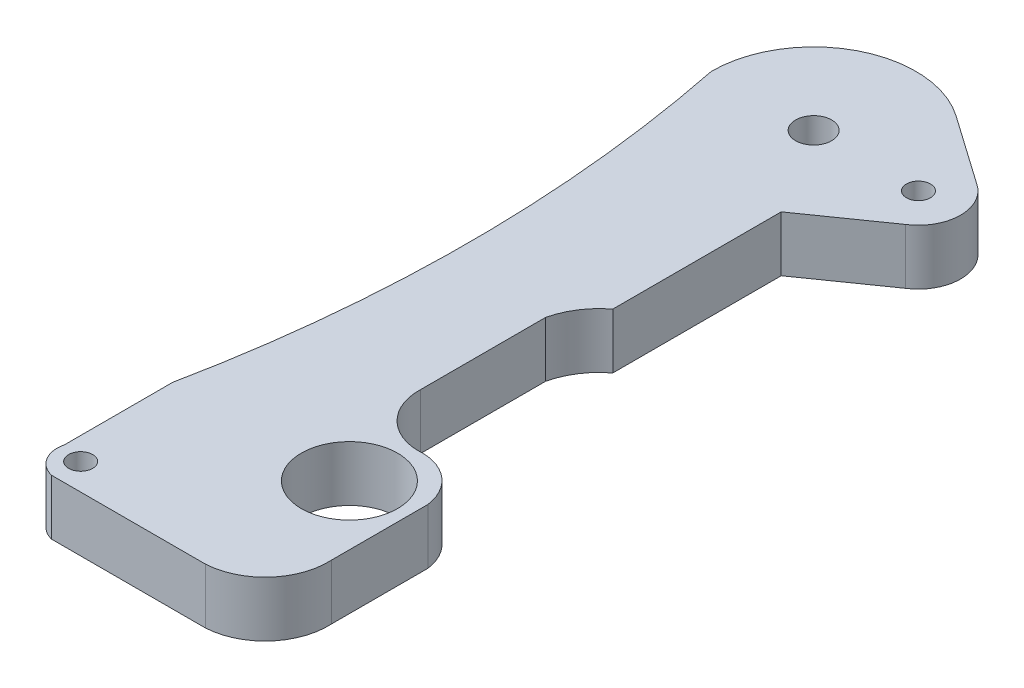
ISO-10303-21;
HEADER;
FILE_DESCRIPTION(('STEP AP214'),'2;1');
FILE_NAME('part.step','',(''),(''),'','','');
FILE_SCHEMA(('AUTOMOTIVE_DESIGN { 1 0 10303 214 1 1 1 1 }'));
ENDSEC;
DATA;
#1=APPLICATION_CONTEXT('core data for automotive mechanical design processes');
#2=APPLICATION_PROTOCOL_DEFINITION('international standard','automotive_design',2000,#1);
#3=PRODUCT_CONTEXT('',#1,'mechanical');
#4=PRODUCT('Part','Part','',(#3));
#5=PRODUCT_RELATED_PRODUCT_CATEGORY('part','',(#4));
#6=PRODUCT_DEFINITION_FORMATION('','',#4);
#7=PRODUCT_DEFINITION_CONTEXT('part definition',#1,'design');
#8=PRODUCT_DEFINITION('design','',#6,#7);
#9=PRODUCT_DEFINITION_SHAPE('','',#8);
#10=(LENGTH_UNIT() NAMED_UNIT(*) SI_UNIT(.MILLI.,.METRE.));
#11=(NAMED_UNIT(*) PLANE_ANGLE_UNIT() SI_UNIT($,.RADIAN.));
#12=(NAMED_UNIT(*) SI_UNIT($,.STERADIAN.) SOLID_ANGLE_UNIT());
#13=UNCERTAINTY_MEASURE_WITH_UNIT(LENGTH_MEASURE(1.E-05),#10,'distance_accuracy_value','');
#14=(GEOMETRIC_REPRESENTATION_CONTEXT(3) GLOBAL_UNCERTAINTY_ASSIGNED_CONTEXT((#13)) GLOBAL_UNIT_ASSIGNED_CONTEXT((#10,
#11,#12)) REPRESENTATION_CONTEXT('',''));
#15=CARTESIAN_POINT('',(0.,0.,0.));
#16=DIRECTION('',(0.,0.,1.));
#17=DIRECTION('',(1.,0.,0.));
#18=AXIS2_PLACEMENT_3D('',#15,#16,#17);
#19=CARTESIAN_POINT('',(0.,4.6,-14.739469580212));
#20=DIRECTION('',(0.,0.,-1.));
#21=DIRECTION('',(-1.,0.,0.));
#22=AXIS2_PLACEMENT_3D('',#19,#20,#21);
#23=PLANE('',#22);
#24=DIRECTION('',(1.,0.,0.));
#25=VECTOR('',#24,1.);
#26=CARTESIAN_POINT('',(0.,0.,-14.739469580212));
#27=LINE('',#26,#25);
#28=CARTESIAN_POINT('',(23.3424677458322,0.,-14.739469580212));
#29=VERTEX_POINT('',#28);
#30=CARTESIAN_POINT('',(36.1321842689916,0.,-14.739469580212));
#31=VERTEX_POINT('',#30);
#32=EDGE_CURVE('E207',#29,#31,#27,.T.);
#33=ORIENTED_EDGE('',*,*,#32,.T.);
#34=DIRECTION('',(0.,-1.,0.));
#35=VECTOR('',#34,1.);
#36=CARTESIAN_POINT('',(36.1321842689916,4.6,-14.739469580212));
#37=LINE('',#36,#35);
#38=CARTESIAN_POINT('',(36.1321842689916,4.6,-14.739469580212));
#39=VERTEX_POINT('',#38);
#40=EDGE_CURVE('E11',#39,#31,#37,.T.);
#41=ORIENTED_EDGE('',*,*,#40,.F.);
#42=DIRECTION('',(1.,0.,0.));
#43=VECTOR('',#42,1.);
#44=CARTESIAN_POINT('',(0.,4.6,-14.739469580212));
#45=LINE('',#44,#43);
#46=CARTESIAN_POINT('',(23.3424677458322,4.6,-14.739469580212));
#47=VERTEX_POINT('',#46);
#48=EDGE_CURVE('E640',#47,#39,#45,.T.);
#49=ORIENTED_EDGE('',*,*,#48,.F.);
#50=DIRECTION('',(0.,-1.,0.));
#51=VECTOR('',#50,1.);
#52=CARTESIAN_POINT('',(23.3424677458322,4.6,-14.739469580212));
#53=LINE('',#52,#51);
#54=EDGE_CURVE('E187',#47,#29,#53,.T.);
#55=ORIENTED_EDGE('',*,*,#54,.T.);
#56=EDGE_LOOP('',(#33,#41,#49,#55));
#57=FACE_BOUND('',#56,.T.);
#58=ADVANCED_FACE('F47',(#57),#23,.F.);
#59=CARTESIAN_POINT('',(35.8456908181647,4.6,-19.9845961419274));
#60=DIRECTION('',(0.,-1.,0.));
#61=DIRECTION('',(0.,0.,-1.));
#62=AXIS2_PLACEMENT_3D('',#59,#60,#61);
#63=CYLINDRICAL_SURFACE('',#62,5.2529449974066);
#64=CARTESIAN_POINT('',(35.8456908181647,0.,-19.9845961419274));
#65=DIRECTION('',(0.,1.,0.));
#66=DIRECTION('',(0.,0.,1.));
#67=AXIS2_PLACEMENT_3D('',#64,#65,#66);
#68=CIRCLE('',#67,5.2529449974066);
#69=CARTESIAN_POINT('',(41.09081737988,0.,-20.2710895927543));
#70=VERTEX_POINT('',#69);
#71=EDGE_CURVE('E211',#31,#70,#68,.T.);
#72=ORIENTED_EDGE('',*,*,#71,.T.);
#73=DIRECTION('',(0.,-1.,0.));
#74=VECTOR('',#73,1.);
#75=CARTESIAN_POINT('',(41.09081737988,4.6,-20.2710895927543));
#76=LINE('',#75,#74);
#77=CARTESIAN_POINT('',(41.09081737988,4.6,-20.2710895927543));
#78=VERTEX_POINT('',#77);
#79=EDGE_CURVE('E57',#78,#70,#76,.T.);
#80=ORIENTED_EDGE('',*,*,#79,.F.);
#81=CARTESIAN_POINT('',(35.8456908181647,4.6,-19.9845961419274));
#82=DIRECTION('',(0.,1.,0.));
#83=DIRECTION('',(0.,0.,1.));
#84=AXIS2_PLACEMENT_3D('',#81,#82,#83);
#85=CIRCLE('',#84,5.2529449974066);
#86=EDGE_CURVE('E125',#39,#78,#85,.T.);
#87=ORIENTED_EDGE('',*,*,#86,.F.);
#88=ORIENTED_EDGE('',*,*,#40,.T.);
#89=EDGE_LOOP('',(#72,#80,#87,#88));
#90=FACE_BOUND('',#89,.T.);
#91=ADVANCED_FACE('F368',(#90),#63,.T.);
#92=CARTESIAN_POINT('',(41.09081737988,4.6,0.));
#93=DIRECTION('',(-1.,0.,0.));
#94=DIRECTION('',(0.,0.,1.));
#95=AXIS2_PLACEMENT_3D('',#92,#93,#94);
#96=PLANE('',#95);
#97=DIRECTION('',(0.,0.,-1.));
#98=VECTOR('',#97,1.);
#99=CARTESIAN_POINT('',(41.09081737988,0.,0.));
#100=LINE('',#99,#98);
#101=CARTESIAN_POINT('',(41.09081737988,0.,-28.2862941007237));
#102=VERTEX_POINT('',#101);
#103=EDGE_CURVE('E214',#70,#102,#100,.T.);
#104=ORIENTED_EDGE('',*,*,#103,.T.);
#105=DIRECTION('',(0.,-1.,0.));
#106=VECTOR('',#105,1.);
#107=CARTESIAN_POINT('',(41.09081737988,4.6,-28.2862941007237));
#108=LINE('',#107,#106);
#109=CARTESIAN_POINT('',(41.09081737988,4.6,-28.2862941007237));
#110=VERTEX_POINT('',#109);
#111=EDGE_CURVE('E290',#110,#102,#108,.T.);
#112=ORIENTED_EDGE('',*,*,#111,.F.);
#113=DIRECTION('',(0.,0.,-1.));
#114=VECTOR('',#113,1.);
#115=CARTESIAN_POINT('',(41.09081737988,4.6,0.));
#116=LINE('',#115,#114);
#117=EDGE_CURVE('E300',#78,#110,#116,.T.);
#118=ORIENTED_EDGE('',*,*,#117,.F.);
#119=ORIENTED_EDGE('',*,*,#79,.T.);
#120=EDGE_LOOP('',(#104,#112,#118,#119));
#121=FACE_BOUND('',#120,.T.);
#122=ADVANCED_FACE('F298',(#121),#96,.F.);
#123=CARTESIAN_POINT('',(37.1255272206283,4.6,-27.7604861957421));
#124=DIRECTION('',(0.,-1.,0.));
#125=DIRECTION('',(0.,0.,-1.));
#126=AXIS2_PLACEMENT_3D('',#123,#124,#125);
#127=CYLINDRICAL_SURFACE('',#126,4.);
#128=CARTESIAN_POINT('',(37.1255272206283,0.,-27.7604861957421));
#129=DIRECTION('',(0.,1.,0.));
#130=DIRECTION('',(0.,0.,1.));
#131=AXIS2_PLACEMENT_3D('',#128,#129,#130);
#132=CIRCLE('',#131,4.);
#133=CARTESIAN_POINT('',(36.7123387364667,0.,-31.7390883719538));
#134=VERTEX_POINT('',#133);
#135=EDGE_CURVE('E217',#102,#134,#132,.T.);
#136=ORIENTED_EDGE('',*,*,#135,.T.);
#137=DIRECTION('',(0.,-1.,0.));
#138=VECTOR('',#137,1.);
#139=CARTESIAN_POINT('',(36.7123387364667,4.6,-31.7390883719538));
#140=LINE('',#139,#138);
#141=CARTESIAN_POINT('',(36.7123387364667,4.6,-31.7390883719538));
#142=VERTEX_POINT('',#141);
#143=EDGE_CURVE('E286',#142,#134,#140,.T.);
#144=ORIENTED_EDGE('',*,*,#143,.F.);
#145=CARTESIAN_POINT('',(37.1255272206283,4.6,-27.7604861957421));
#146=DIRECTION('',(0.,1.,0.));
#147=DIRECTION('',(0.,0.,1.));
#148=AXIS2_PLACEMENT_3D('',#145,#146,#147);
#149=CIRCLE('',#148,4.);
#150=EDGE_CURVE('E319',#110,#142,#149,.T.);
#151=ORIENTED_EDGE('',*,*,#150,.F.);
#152=ORIENTED_EDGE('',*,*,#111,.T.);
#153=EDGE_LOOP('',(#136,#144,#151,#152));
#154=FACE_BOUND('',#153,.T.);
#155=ADVANCED_FACE('F309',(#154),#127,.T.);
#156=CARTESIAN_POINT('',(36.8735410270205,4.6,-36.092931668784));
#157=DIRECTION('',(0.,-1.,0.));
#158=DIRECTION('',(0.,0.,-1.));
#159=AXIS2_PLACEMENT_3D('',#156,#157,#158);
#160=CYLINDRICAL_SURFACE('',#159,4.35682655516985);
#161=CARTESIAN_POINT('',(36.8735410270205,0.,-36.092931668784));
#162=DIRECTION('',(0.,1.,0.));
#163=DIRECTION('',(0.,0.,1.));
#164=AXIS2_PLACEMENT_3D('',#161,#162,#163);
#165=CIRCLE('',#164,4.35682655516985);
#166=CARTESIAN_POINT('',(32.5196977301903,0.,-36.2541339593378));
#167=VERTEX_POINT('',#166);
#168=EDGE_CURVE('E220',#134,#167,#165,.F.);
#169=ORIENTED_EDGE('',*,*,#168,.T.);
#170=DIRECTION('',(0.,-1.,0.));
#171=VECTOR('',#170,1.);
#172=CARTESIAN_POINT('',(32.5196977301903,4.6,-36.2541339593378));
#173=LINE('',#172,#171);
#174=CARTESIAN_POINT('',(32.5196977301903,4.6,-36.2541339593378));
#175=VERTEX_POINT('',#174);
#176=EDGE_CURVE('E282',#175,#167,#173,.T.);
#177=ORIENTED_EDGE('',*,*,#176,.F.);
#178=CARTESIAN_POINT('',(36.8735410270205,4.6,-36.092931668784));
#179=DIRECTION('',(0.,1.,0.));
#180=DIRECTION('',(0.,0.,1.));
#181=AXIS2_PLACEMENT_3D('',#178,#179,#180);
#182=CIRCLE('',#181,4.35682655516985);
#183=EDGE_CURVE('E315',#142,#175,#182,.F.);
#184=ORIENTED_EDGE('',*,*,#183,.F.);
#185=ORIENTED_EDGE('',*,*,#143,.T.);
#186=EDGE_LOOP('',(#169,#177,#184,#185));
#187=FACE_BOUND('',#186,.T.);
#188=ADVANCED_FACE('F313',(#187),#160,.F.);
#189=CARTESIAN_POINT('',(32.5196977301903,4.6,0.));
#190=DIRECTION('',(-1.,0.,0.));
#191=DIRECTION('',(0.,0.,1.));
#192=AXIS2_PLACEMENT_3D('',#189,#190,#191);
#193=PLANE('',#192);
#194=DIRECTION('',(0.,0.,-1.));
#195=VECTOR('',#194,1.);
#196=CARTESIAN_POINT('',(32.5196977301903,0.,0.));
#197=LINE('',#196,#195);
#198=CARTESIAN_POINT('',(32.5196977301903,0.,-46.6400327583967));
#199=VERTEX_POINT('',#198);
#200=EDGE_CURVE('E223',#167,#199,#197,.T.);
#201=ORIENTED_EDGE('',*,*,#200,.T.);
#202=DIRECTION('',(0.,-1.,0.));
#203=VECTOR('',#202,1.);
#204=CARTESIAN_POINT('',(32.5196977301903,4.6,-46.6400327583967));
#205=LINE('',#204,#203);
#206=CARTESIAN_POINT('',(32.5196977301903,4.6,-46.6400327583967));
#207=VERTEX_POINT('',#206);
#208=EDGE_CURVE('E278',#207,#199,#205,.T.);
#209=ORIENTED_EDGE('',*,*,#208,.F.);
#210=DIRECTION('',(0.,0.,-1.));
#211=VECTOR('',#210,1.);
#212=CARTESIAN_POINT('',(32.5196977301903,4.6,0.));
#213=LINE('',#212,#211);
#214=EDGE_CURVE('E318',#175,#207,#213,.T.);
#215=ORIENTED_EDGE('',*,*,#214,.F.);
#216=ORIENTED_EDGE('',*,*,#176,.T.);
#217=EDGE_LOOP('',(#201,#209,#215,#216));
#218=FACE_BOUND('',#217,.T.);
#219=ADVANCED_FACE('F547',(#218),#193,.F.);
#220=CARTESIAN_POINT('',(38.3164986371318,4.6,-45.2892608143263));
#221=DIRECTION('',(0.,-1.,0.));
#222=DIRECTION('',(0.,0.,-1.));
#223=AXIS2_PLACEMENT_3D('',#220,#221,#222);
#224=CYLINDRICAL_SURFACE('',#223,5.95209925989195);
#225=CARTESIAN_POINT('',(38.3164986371318,0.,-45.2892608143263));
#226=DIRECTION('',(0.,1.,0.));
#227=DIRECTION('',(0.,0.,1.));
#228=AXIS2_PLACEMENT_3D('',#225,#226,#227);
#229=CIRCLE('',#228,5.95209925989195);
#230=CARTESIAN_POINT('',(34.7131963883495,0.,-50.0267388885264));
#231=VERTEX_POINT('',#230);
#232=EDGE_CURVE('E226',#199,#231,#229,.F.);
#233=ORIENTED_EDGE('',*,*,#232,.T.);
#234=DIRECTION('',(0.,-1.,0.));
#235=VECTOR('',#234,1.);
#236=CARTESIAN_POINT('',(34.7131963883495,4.6,-50.0267388885264));
#237=LINE('',#236,#235);
#238=CARTESIAN_POINT('',(34.7131963883495,4.6,-50.0267388885264));
#239=VERTEX_POINT('',#238);
#240=EDGE_CURVE('E275',#239,#231,#237,.T.);
#241=ORIENTED_EDGE('',*,*,#240,.F.);
#242=CARTESIAN_POINT('',(38.3164986371318,4.6,-45.2892608143263));
#243=DIRECTION('',(0.,1.,0.));
#244=DIRECTION('',(0.,0.,1.));
#245=AXIS2_PLACEMENT_3D('',#242,#243,#244);
#246=CIRCLE('',#245,5.95209925989195);
#247=EDGE_CURVE('E323',#207,#239,#246,.F.);
#248=ORIENTED_EDGE('',*,*,#247,.F.);
#249=ORIENTED_EDGE('',*,*,#208,.T.);
#250=EDGE_LOOP('',(#233,#241,#248,#249));
#251=FACE_BOUND('',#250,.T.);
#252=ADVANCED_FACE('F537',(#251),#224,.F.);
#253=CARTESIAN_POINT('',(34.7131963883496,4.6,0.));
#254=DIRECTION('',(1.,0.,0.));
#255=DIRECTION('',(0.,0.,-1.));
#256=AXIS2_PLACEMENT_3D('',#253,#254,#255);
#257=PLANE('',#256);
#258=DIRECTION('',(0.,0.,1.));
#259=VECTOR('',#258,1.);
#260=CARTESIAN_POINT('',(34.7131963883496,0.,0.));
#261=LINE('',#260,#259);
#262=CARTESIAN_POINT('',(34.7131963883495,0.,-64.0267388885264));
#263=VERTEX_POINT('',#262);
#264=EDGE_CURVE('E230',#263,#231,#261,.T.);
#265=ORIENTED_EDGE('',*,*,#264,.F.);
#266=DIRECTION('',(0.,-1.,0.));
#267=VECTOR('',#266,1.);
#268=CARTESIAN_POINT('',(34.7131963883495,4.6,-64.0267388885264));
#269=LINE('',#268,#267);
#270=CARTESIAN_POINT('',(34.7131963883495,4.6,-64.0267388885264));
#271=VERTEX_POINT('',#270);
#272=EDGE_CURVE('E272',#271,#263,#269,.T.);
#273=ORIENTED_EDGE('',*,*,#272,.F.);
#274=DIRECTION('',(0.,0.,1.));
#275=VECTOR('',#274,1.);
#276=CARTESIAN_POINT('',(34.7131963883496,4.6,0.));
#277=LINE('',#276,#275);
#278=EDGE_CURVE('E330',#271,#239,#277,.T.);
#279=ORIENTED_EDGE('',*,*,#278,.T.);
#280=ORIENTED_EDGE('',*,*,#240,.T.);
#281=EDGE_LOOP('',(#265,#273,#279,#280));
#282=FACE_BOUND('',#281,.T.);
#283=ADVANCED_FACE('F527',(#282),#257,.T.);
#284=CARTESIAN_POINT('',(-18.6535235605097,4.6,-26.5931798477903));
#285=DIRECTION('',(0.574253354174526,0.,0.81867764426501));
#286=DIRECTION('',(0.81867764426501,0.,-0.574253354174526));
#287=AXIS2_PLACEMENT_3D('',#284,#285,#286);
#288=PLANE('',#287);
#289=DIRECTION('',(-0.81867764426501,0.,0.574253354174526));
#290=VECTOR('',#289,1.);
#291=CARTESIAN_POINT('',(-18.6535235605097,0.,-26.5931798477903));
#292=LINE('',#291,#290);
#293=CARTESIAN_POINT('',(40.7852701998782,0.,-68.2859351393243));
#294=VERTEX_POINT('',#293);
#295=EDGE_CURVE('E234',#294,#263,#292,.T.);
#296=ORIENTED_EDGE('',*,*,#295,.F.);
#297=DIRECTION('',(0.,-1.,0.));
#298=VECTOR('',#297,1.);
#299=CARTESIAN_POINT('',(40.7852701998782,4.6,-68.2859351393243));
#300=LINE('',#299,#298);
#301=CARTESIAN_POINT('',(40.7852701998782,4.6,-68.2859351393243));
#302=VERTEX_POINT('',#301);
#303=EDGE_CURVE('E269',#302,#294,#300,.T.);
#304=ORIENTED_EDGE('',*,*,#303,.F.);
#305=DIRECTION('',(-0.81867764426501,0.,0.574253354174526));
#306=VECTOR('',#305,1.);
#307=CARTESIAN_POINT('',(-18.6535235605097,4.6,-26.5931798477903));
#308=LINE('',#307,#306);
#309=EDGE_CURVE('E334',#302,#271,#308,.T.);
#310=ORIENTED_EDGE('',*,*,#309,.T.);
#311=ORIENTED_EDGE('',*,*,#272,.T.);
#312=EDGE_LOOP('',(#296,#304,#310,#311));
#313=FACE_BOUND('',#312,.T.);
#314=ADVANCED_FACE('F518',(#313),#288,.T.);
#315=CARTESIAN_POINT('',(38.907336679625,4.6,-71.239469580212));
#316=DIRECTION('',(0.,-1.,0.));
#317=DIRECTION('',(0.,0.,-1.));
#318=AXIS2_PLACEMENT_3D('',#315,#316,#317);
#319=CYLINDRICAL_SURFACE('',#318,3.5);
#320=CARTESIAN_POINT('',(38.907336679625,0.,-71.239469580212));
#321=DIRECTION('',(0.,1.,0.));
#322=DIRECTION('',(0.,0.,1.));
#323=AXIS2_PLACEMENT_3D('',#320,#321,#322);
#324=CIRCLE('',#323,3.5);
#325=CARTESIAN_POINT('',(40.7852701998782,0.,-74.1930040210996));
#326=VERTEX_POINT('',#325);
#327=EDGE_CURVE('E238',#294,#326,#324,.T.);
#328=ORIENTED_EDGE('',*,*,#327,.T.);
#329=DIRECTION('',(0.,-1.,0.));
#330=VECTOR('',#329,1.);
#331=CARTESIAN_POINT('',(40.7852701998782,4.6,-74.1930040210996));
#332=LINE('',#331,#330);
#333=CARTESIAN_POINT('',(40.7852701998782,4.6,-74.1930040210996));
#334=VERTEX_POINT('',#333);
#335=EDGE_CURVE('E266',#334,#326,#332,.T.);
#336=ORIENTED_EDGE('',*,*,#335,.F.);
#337=CARTESIAN_POINT('',(38.907336679625,4.6,-71.239469580212));
#338=DIRECTION('',(0.,1.,0.));
#339=DIRECTION('',(0.,0.,1.));
#340=AXIS2_PLACEMENT_3D('',#337,#338,#339);
#341=CIRCLE('',#340,3.5);
#342=EDGE_CURVE('E338',#302,#334,#341,.T.);
#343=ORIENTED_EDGE('',*,*,#342,.F.);
#344=ORIENTED_EDGE('',*,*,#303,.T.);
#345=EDGE_LOOP('',(#328,#336,#343,#344));
#346=FACE_BOUND('',#345,.T.);
#347=ADVANCED_FACE('F353',(#346),#319,.T.);
#348=CARTESIAN_POINT('',(48.3298697480119,4.6,-68.9009191244746));
#349=DIRECTION('',(0.574253354174525,0.,-0.818677644265011));
#350=DIRECTION('',(-0.818677644265011,0.,-0.574253354174525));
#351=AXIS2_PLACEMENT_3D('',#348,#349,#350);
#352=PLANE('',#351);
#353=DIRECTION('',(0.818677644265011,0.,0.574253354174525));
#354=VECTOR('',#353,1.);
#355=CARTESIAN_POINT('',(48.3298697480119,0.,-68.9009191244746));
#356=LINE('',#355,#354);
#357=CARTESIAN_POINT('',(35.0752667977107,0.,-78.1982295564646));
#358=VERTEX_POINT('',#357);
#359=EDGE_CURVE('E242',#358,#326,#356,.T.);
#360=ORIENTED_EDGE('',*,*,#359,.F.);
#361=DIRECTION('',(0.,-1.,0.));
#362=VECTOR('',#361,1.);
#363=CARTESIAN_POINT('',(35.0752667977107,4.6,-78.1982295564646));
#364=LINE('',#363,#362);
#365=CARTESIAN_POINT('',(35.0752667977107,4.6,-78.1982295564646));
#366=VERTEX_POINT('',#365);
#367=EDGE_CURVE('E263',#366,#358,#364,.T.);
#368=ORIENTED_EDGE('',*,*,#367,.F.);
#369=DIRECTION('',(0.818677644265011,0.,0.574253354174525));
#370=VECTOR('',#369,1.);
#371=CARTESIAN_POINT('',(48.3298697480119,4.6,-68.9009191244746));
#372=LINE('',#371,#370);
#373=EDGE_CURVE('E341',#366,#334,#372,.T.);
#374=ORIENTED_EDGE('',*,*,#373,.T.);
#375=ORIENTED_EDGE('',*,*,#335,.T.);
#376=EDGE_LOOP('',(#360,#368,#374,#375));
#377=FACE_BOUND('',#376,.T.);
#378=ADVANCED_FACE('F347',(#377),#352,.T.);
#379=CARTESIAN_POINT('',(30.1941132872272,4.6,-71.239469580212));
#380=DIRECTION('',(0.,-1.,0.));
#381=DIRECTION('',(0.,0.,-1.));
#382=AXIS2_PLACEMENT_3D('',#379,#380,#381);
#383=CYLINDRICAL_SURFACE('',#382,8.5);
#384=CARTESIAN_POINT('',(30.1941132872272,0.,-71.239469580212));
#385=DIRECTION('',(0.,1.,0.));
#386=DIRECTION('',(0.,0.,1.));
#387=AXIS2_PLACEMENT_3D('',#384,#385,#386);
#388=CIRCLE('',#387,8.5);
#389=CARTESIAN_POINT('',(21.6941132872272,0.,-71.239469580212));
#390=VERTEX_POINT('',#389);
#391=EDGE_CURVE('E246',#358,#390,#388,.T.);
#392=ORIENTED_EDGE('',*,*,#391,.T.);
#393=DIRECTION('',(0.,-1.,0.));
#394=VECTOR('',#393,1.);
#395=CARTESIAN_POINT('',(21.6941132872272,4.6,-71.239469580212));
#396=LINE('',#395,#394);
#397=CARTESIAN_POINT('',(21.6941132872272,4.6,-71.239469580212));
#398=VERTEX_POINT('',#397);
#399=EDGE_CURVE('E181',#398,#390,#396,.T.);
#400=ORIENTED_EDGE('',*,*,#399,.F.);
#401=CARTESIAN_POINT('',(30.1941132872272,4.6,-71.239469580212));
#402=DIRECTION('',(0.,1.,0.));
#403=DIRECTION('',(0.,0.,1.));
#404=AXIS2_PLACEMENT_3D('',#401,#402,#403);
#405=CIRCLE('',#404,8.5);
#406=EDGE_CURVE('E166',#366,#398,#405,.T.);
#407=ORIENTED_EDGE('',*,*,#406,.F.);
#408=ORIENTED_EDGE('',*,*,#367,.T.);
#409=EDGE_LOOP('',(#392,#400,#407,#408));
#410=FACE_BOUND('',#409,.T.);
#411=ADVANCED_FACE('F358',(#410),#383,.T.);
#412=CARTESIAN_POINT('',(-88.6741516737802,4.6,-48.8513825944135));
#413=DIRECTION('',(0.,-1.,0.));
#414=DIRECTION('',(0.,0.,-1.));
#415=AXIS2_PLACEMENT_3D('',#412,#413,#414);
#416=CYLINDRICAL_SURFACE('',#415,112.616075004356);
#417=CARTESIAN_POINT('',(-88.6741516737802,0.,-48.8513825944135));
#418=DIRECTION('',(0.,1.,0.));
#419=DIRECTION('',(0.,0.,1.));
#420=AXIS2_PLACEMENT_3D('',#417,#418,#419);
#421=CIRCLE('',#420,112.616075004356);
#422=CARTESIAN_POINT('',(21.6941132872273,0.,-26.4632956086153));
#423=VERTEX_POINT('',#422);
#424=EDGE_CURVE('E176',#390,#423,#421,.F.);
#425=ORIENTED_EDGE('',*,*,#424,.T.);
#426=DIRECTION('',(0.,-1.,0.));
#427=VECTOR('',#426,1.);
#428=CARTESIAN_POINT('',(21.6941132872273,4.6,-26.4632956086153));
#429=LINE('',#428,#427);
#430=CARTESIAN_POINT('',(21.6941132872273,4.6,-26.4632956086153));
#431=VERTEX_POINT('',#430);
#432=EDGE_CURVE('E173',#431,#423,#429,.T.);
#433=ORIENTED_EDGE('',*,*,#432,.F.);
#434=CARTESIAN_POINT('',(-88.6741516737802,4.6,-48.8513825944135));
#435=DIRECTION('',(0.,1.,0.));
#436=DIRECTION('',(0.,0.,1.));
#437=AXIS2_PLACEMENT_3D('',#434,#435,#436);
#438=CIRCLE('',#437,112.616075004356);
#439=EDGE_CURVE('E159',#398,#431,#438,.F.);
#440=ORIENTED_EDGE('',*,*,#439,.F.);
#441=ORIENTED_EDGE('',*,*,#399,.T.);
#442=EDGE_LOOP('',(#425,#433,#440,#441));
#443=FACE_BOUND('',#442,.T.);
#444=ADVANCED_FACE('F174',(#443),#416,.F.);
#445=CARTESIAN_POINT('',(21.6941132872271,4.6,1.33807244835034E-13));
#446=DIRECTION('',(-1.,0.,0.));
#447=DIRECTION('',(0.,0.,1.));
#448=AXIS2_PLACEMENT_3D('',#445,#446,#447);
#449=PLANE('',#448);
#450=DIRECTION('',(0.,0.,-1.));
#451=VECTOR('',#450,1.);
#452=CARTESIAN_POINT('',(21.6941132872271,0.,1.33807244835034E-13));
#453=LINE('',#452,#451);
#454=CARTESIAN_POINT('',(21.6941132872272,0.,-17.4632956086153));
#455=VERTEX_POINT('',#454);
#456=EDGE_CURVE('E251',#455,#423,#453,.T.);
#457=ORIENTED_EDGE('',*,*,#456,.F.);
#458=DIRECTION('',(0.,-1.,0.));
#459=VECTOR('',#458,1.);
#460=CARTESIAN_POINT('',(21.6941132872272,4.6,-17.4632956086153));
#461=LINE('',#460,#459);
#462=CARTESIAN_POINT('',(21.6941132872272,4.6,-17.4632956086153));
#463=VERTEX_POINT('',#462);
#464=EDGE_CURVE('E114',#463,#455,#461,.T.);
#465=ORIENTED_EDGE('',*,*,#464,.F.);
#466=DIRECTION('',(0.,0.,-1.));
#467=VECTOR('',#466,1.);
#468=CARTESIAN_POINT('',(21.6941132872271,4.6,1.33807244835034E-13));
#469=LINE('',#468,#467);
#470=EDGE_CURVE('E163',#463,#431,#469,.T.);
#471=ORIENTED_EDGE('',*,*,#470,.T.);
#472=ORIENTED_EDGE('',*,*,#432,.T.);
#473=EDGE_LOOP('',(#457,#465,#471,#472));
#474=FACE_BOUND('',#473,.T.);
#475=ADVANCED_FACE('F183',(#474),#449,.T.);
#476=CARTESIAN_POINT('',(36.1321842689916,4.6,-26.71617415409));
#477=DIRECTION('',(0.,-1.,0.));
#478=DIRECTION('',(0.,0.,-1.));
#479=AXIS2_PLACEMENT_3D('',#476,#477,#478);
#480=CYLINDRICAL_SURFACE('',#479,4.00000000000001);
#481=CARTESIAN_POINT('',(36.1321842689916,4.6,-26.71617415409));
#482=DIRECTION('',(0.,1.,0.));
#483=DIRECTION('',(0.,0.,1.));
#484=AXIS2_PLACEMENT_3D('',#481,#482,#483);
#485=CIRCLE('',#484,4.00000000000001);
#486=CARTESIAN_POINT('',(36.1321842689916,4.6,-22.71617415409));
#487=VERTEX_POINT('',#486);
#488=EDGE_CURVE('E638',#487,#487,#485,.T.);
#489=ORIENTED_EDGE('',*,*,#488,.T.);
#490=EDGE_LOOP('',(#489));
#491=FACE_BOUND('',#490,.T.);
#492=CARTESIAN_POINT('',(36.1321842689916,0.,-26.71617415409));
#493=DIRECTION('',(0.,1.,0.));
#494=DIRECTION('',(0.,0.,1.));
#495=AXIS2_PLACEMENT_3D('',#492,#493,#494);
#496=CIRCLE('',#495,4.00000000000001);
#497=CARTESIAN_POINT('',(36.1321842689916,0.,-22.71617415409));
#498=VERTEX_POINT('',#497);
#499=EDGE_CURVE('E203',#498,#498,#496,.T.);
#500=ORIENTED_EDGE('',*,*,#499,.F.);
#501=EDGE_LOOP('',(#500));
#502=FACE_BOUND('',#501,.T.);
#503=ADVANCED_FACE('F377',(#491,#502),#480,.F.);
#504=CARTESIAN_POINT('',(23.5664125670901,4.6,-16.9434947404766));
#505=DIRECTION('',(0.,-1.,0.));
#506=DIRECTION('',(0.,0.,-1.));
#507=AXIS2_PLACEMENT_3D('',#504,#505,#506);
#508=CYLINDRICAL_SURFACE('',#507,0.999999999999791);
#509=CARTESIAN_POINT('',(23.5664125670901,4.6,-16.9434947404766));
#510=DIRECTION('',(0.,1.,0.));
#511=DIRECTION('',(0.,0.,1.));
#512=AXIS2_PLACEMENT_3D('',#509,#510,#511);
#513=CIRCLE('',#512,0.999999999999791);
#514=CARTESIAN_POINT('',(23.5664125670901,4.6,-15.9434947404768));
#515=VERTEX_POINT('',#514);
#516=EDGE_CURVE('E635',#515,#515,#513,.T.);
#517=ORIENTED_EDGE('',*,*,#516,.T.);
#518=EDGE_LOOP('',(#517));
#519=FACE_BOUND('',#518,.T.);
#520=CARTESIAN_POINT('',(23.5664125670901,0.,-16.9434947404766));
#521=DIRECTION('',(0.,1.,0.));
#522=DIRECTION('',(0.,0.,1.));
#523=AXIS2_PLACEMENT_3D('',#520,#521,#522);
#524=CIRCLE('',#523,0.999999999999791);
#525=CARTESIAN_POINT('',(23.5664125670901,0.,-15.9434947404768));
#526=VERTEX_POINT('',#525);
#527=EDGE_CURVE('E199',#526,#526,#524,.T.);
#528=ORIENTED_EDGE('',*,*,#527,.F.);
#529=EDGE_LOOP('',(#528));
#530=FACE_BOUND('',#529,.T.);
#531=ADVANCED_FACE('F380',(#519,#530),#508,.F.);
#532=CARTESIAN_POINT('',(38.907336679625,4.6,-71.239469580212));
#533=DIRECTION('',(0.,-1.,0.));
#534=DIRECTION('',(0.,0.,-1.));
#535=AXIS2_PLACEMENT_3D('',#532,#533,#534);
#536=CYLINDRICAL_SURFACE('',#535,0.999999999999998);
#537=CARTESIAN_POINT('',(38.907336679625,4.6,-71.239469580212));
#538=DIRECTION('',(0.,1.,0.));
#539=DIRECTION('',(0.,0.,1.));
#540=AXIS2_PLACEMENT_3D('',#537,#538,#539);
#541=CIRCLE('',#540,0.999999999999998);
#542=CARTESIAN_POINT('',(38.907336679625,4.6,-70.239469580212));
#543=VERTEX_POINT('',#542);
#544=EDGE_CURVE('E395',#543,#543,#541,.T.);
#545=ORIENTED_EDGE('',*,*,#544,.T.);
#546=EDGE_LOOP('',(#545));
#547=FACE_BOUND('',#546,.T.);
#548=CARTESIAN_POINT('',(38.907336679625,0.,-71.239469580212));
#549=DIRECTION('',(0.,1.,0.));
#550=DIRECTION('',(0.,0.,1.));
#551=AXIS2_PLACEMENT_3D('',#548,#549,#550);
#552=CIRCLE('',#551,0.999999999999998);
#553=CARTESIAN_POINT('',(38.907336679625,0.,-70.239469580212));
#554=VERTEX_POINT('',#553);
#555=EDGE_CURVE('E195',#554,#554,#552,.T.);
#556=ORIENTED_EDGE('',*,*,#555,.F.);
#557=EDGE_LOOP('',(#556));
#558=FACE_BOUND('',#557,.T.);
#559=ADVANCED_FACE('F383',(#547,#558),#536,.F.);
#560=CARTESIAN_POINT('',(30.1941132872272,4.6,-71.239469580212));
#561=DIRECTION('',(0.,-1.,0.));
#562=DIRECTION('',(0.,0.,-1.));
#563=AXIS2_PLACEMENT_3D('',#560,#561,#562);
#564=CYLINDRICAL_SURFACE('',#563,1.5);
#565=CARTESIAN_POINT('',(30.1941132872272,4.6,-71.239469580212));
#566=DIRECTION('',(0.,1.,0.));
#567=DIRECTION('',(0.,0.,1.));
#568=AXIS2_PLACEMENT_3D('',#565,#566,#567);
#569=CIRCLE('',#568,1.5);
#570=CARTESIAN_POINT('',(30.1941132872272,4.6,-69.739469580212));
#571=VERTEX_POINT('',#570);
#572=EDGE_CURVE('E256',#571,#571,#569,.T.);
#573=ORIENTED_EDGE('',*,*,#572,.T.);
#574=EDGE_LOOP('',(#573));
#575=FACE_BOUND('',#574,.T.);
#576=CARTESIAN_POINT('',(30.1941132872272,0.,-71.239469580212));
#577=DIRECTION('',(0.,1.,0.));
#578=DIRECTION('',(0.,0.,1.));
#579=AXIS2_PLACEMENT_3D('',#576,#577,#578);
#580=CIRCLE('',#579,1.5);
#581=CARTESIAN_POINT('',(30.1941132872272,0.,-69.739469580212));
#582=VERTEX_POINT('',#581);
#583=EDGE_CURVE('E191',#582,#582,#580,.T.);
#584=ORIENTED_EDGE('',*,*,#583,.F.);
#585=EDGE_LOOP('',(#584));
#586=FACE_BOUND('',#585,.T.);
#587=ADVANCED_FACE('F49',(#575,#586),#564,.F.);
#588=CARTESIAN_POINT('',(23.8802035307314,4.6,-16.925559823716));
#589=DIRECTION('',(0.,-1.,0.));
#590=DIRECTION('',(0.,0.,-1.));
#591=AXIS2_PLACEMENT_3D('',#588,#589,#590);
#592=CYLINDRICAL_SURFACE('',#591,2.25125527808494);
#593=CARTESIAN_POINT('',(23.8802035307314,0.,-16.925559823716));
#594=DIRECTION('',(0.,1.,0.));
#595=DIRECTION('',(0.,0.,1.));
#596=AXIS2_PLACEMENT_3D('',#593,#594,#595);
#597=CIRCLE('',#596,2.25125527808494);
#598=EDGE_CURVE('E117',#455,#29,#597,.T.);
#599=ORIENTED_EDGE('',*,*,#598,.T.);
#600=ORIENTED_EDGE('',*,*,#54,.F.);
#601=CARTESIAN_POINT('',(23.8802035307314,4.6,-16.925559823716));
#602=DIRECTION('',(0.,1.,0.));
#603=DIRECTION('',(0.,0.,1.));
#604=AXIS2_PLACEMENT_3D('',#601,#602,#603);
#605=CIRCLE('',#604,2.25125527808494);
#606=EDGE_CURVE('E65',#463,#47,#605,.T.);
#607=ORIENTED_EDGE('',*,*,#606,.F.);
#608=ORIENTED_EDGE('',*,*,#464,.T.);
#609=EDGE_LOOP('',(#599,#600,#607,#608));
#610=FACE_BOUND('',#609,.T.);
#611=ADVANCED_FACE('F390',(#610),#592,.T.);
#612=CARTESIAN_POINT('',(0.,4.6,0.));
#613=DIRECTION('',(0.,1.,0.));
#614=DIRECTION('',(0.,0.,1.));
#615=AXIS2_PLACEMENT_3D('',#612,#613,#614);
#616=PLANE('',#615);
#617=ORIENTED_EDGE('',*,*,#572,.F.);
#618=EDGE_LOOP('',(#617));
#619=FACE_BOUND('',#618,.T.);
#620=ORIENTED_EDGE('',*,*,#544,.F.);
#621=EDGE_LOOP('',(#620));
#622=FACE_BOUND('',#621,.T.);
#623=ORIENTED_EDGE('',*,*,#516,.F.);
#624=EDGE_LOOP('',(#623));
#625=FACE_BOUND('',#624,.T.);
#626=ORIENTED_EDGE('',*,*,#488,.F.);
#627=EDGE_LOOP('',(#626));
#628=FACE_BOUND('',#627,.T.);
#629=ORIENTED_EDGE('',*,*,#48,.T.);
#630=ORIENTED_EDGE('',*,*,#86,.T.);
#631=ORIENTED_EDGE('',*,*,#117,.T.);
#632=ORIENTED_EDGE('',*,*,#150,.T.);
#633=ORIENTED_EDGE('',*,*,#183,.T.);
#634=ORIENTED_EDGE('',*,*,#214,.T.);
#635=ORIENTED_EDGE('',*,*,#247,.T.);
#636=ORIENTED_EDGE('',*,*,#278,.F.);
#637=ORIENTED_EDGE('',*,*,#309,.F.);
#638=ORIENTED_EDGE('',*,*,#342,.T.);
#639=ORIENTED_EDGE('',*,*,#373,.F.);
#640=ORIENTED_EDGE('',*,*,#406,.T.);
#641=ORIENTED_EDGE('',*,*,#439,.T.);
#642=ORIENTED_EDGE('',*,*,#470,.F.);
#643=ORIENTED_EDGE('',*,*,#606,.T.);
#644=EDGE_LOOP('',(#629,#630,#631,#632,#633,#634,#635,#636,#637,#638,#639,#640,#641,#642,#643));
#645=FACE_BOUND('',#644,.T.);
#646=ADVANCED_FACE('F161',(#619,#622,#625,#628,#645),#616,.T.);
#647=CARTESIAN_POINT('',(0.,0.,0.));
#648=DIRECTION('',(0.,1.,0.));
#649=DIRECTION('',(0.,0.,1.));
#650=AXIS2_PLACEMENT_3D('',#647,#648,#649);
#651=PLANE('',#650);
#652=ORIENTED_EDGE('',*,*,#583,.T.);
#653=EDGE_LOOP('',(#652));
#654=FACE_BOUND('',#653,.T.);
#655=ORIENTED_EDGE('',*,*,#555,.T.);
#656=EDGE_LOOP('',(#655));
#657=FACE_BOUND('',#656,.T.);
#658=ORIENTED_EDGE('',*,*,#527,.T.);
#659=EDGE_LOOP('',(#658));
#660=FACE_BOUND('',#659,.T.);
#661=ORIENTED_EDGE('',*,*,#499,.T.);
#662=EDGE_LOOP('',(#661));
#663=FACE_BOUND('',#662,.T.);
#664=ORIENTED_EDGE('',*,*,#32,.F.);
#665=ORIENTED_EDGE('',*,*,#598,.F.);
#666=ORIENTED_EDGE('',*,*,#456,.T.);
#667=ORIENTED_EDGE('',*,*,#424,.F.);
#668=ORIENTED_EDGE('',*,*,#391,.F.);
#669=ORIENTED_EDGE('',*,*,#359,.T.);
#670=ORIENTED_EDGE('',*,*,#327,.F.);
#671=ORIENTED_EDGE('',*,*,#295,.T.);
#672=ORIENTED_EDGE('',*,*,#264,.T.);
#673=ORIENTED_EDGE('',*,*,#232,.F.);
#674=ORIENTED_EDGE('',*,*,#200,.F.);
#675=ORIENTED_EDGE('',*,*,#168,.F.);
#676=ORIENTED_EDGE('',*,*,#135,.F.);
#677=ORIENTED_EDGE('',*,*,#103,.F.);
#678=ORIENTED_EDGE('',*,*,#71,.F.);
#679=EDGE_LOOP('',(#664,#665,#666,#667,#668,#669,#670,#671,#672,#673,#674,#675,#676,#677,#678));
#680=FACE_BOUND('',#679,.T.);
#681=ADVANCED_FACE('F304',(#654,#657,#660,#663,#680),#651,.F.);
#682=CLOSED_SHELL('',(#58,#91,#122,#155,#188,#219,#252,#283,#314,#347,#378,#411,#444,#475,#503,
#531,#559,#587,#611,#646,#681));
#683=MANIFOLD_SOLID_BREP('B2',#682);
#684=ADVANCED_BREP_SHAPE_REPRESENTATION('',(#18,#683),#14);
#685=SHAPE_DEFINITION_REPRESENTATION(#9,#684);
ENDSEC;
END-ISO-10303-21;
